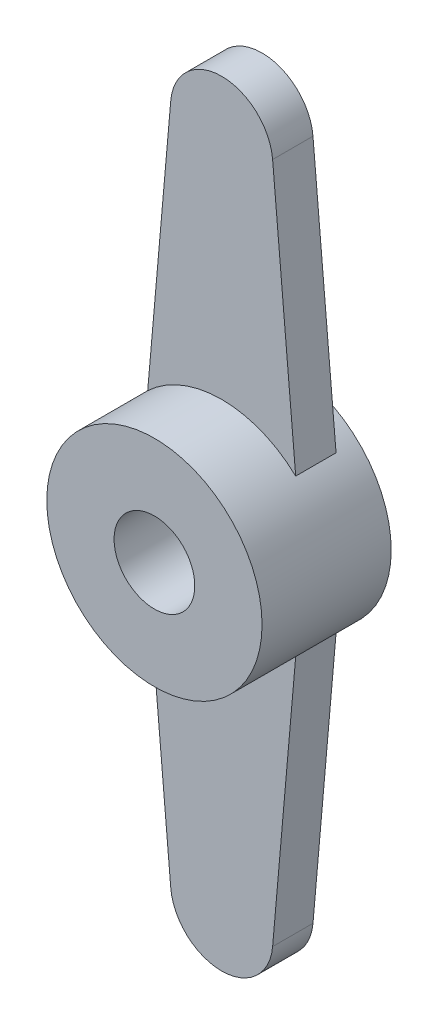
ISO-10303-21;
HEADER;
FILE_DESCRIPTION(('STEP AP214'),'2;1');
FILE_NAME('part.step','',(''),(''),'','','');
FILE_SCHEMA(('AUTOMOTIVE_DESIGN { 1 0 10303 214 1 1 1 1 }'));
ENDSEC;
DATA;
#1=APPLICATION_CONTEXT('core data for automotive mechanical design processes');
#2=APPLICATION_PROTOCOL_DEFINITION('international standard','automotive_design',2000,#1);
#3=PRODUCT_CONTEXT('',#1,'mechanical');
#4=PRODUCT('Part','Part','',(#3));
#5=PRODUCT_RELATED_PRODUCT_CATEGORY('part','',(#4));
#6=PRODUCT_DEFINITION_FORMATION('','',#4);
#7=PRODUCT_DEFINITION_CONTEXT('part definition',#1,'design');
#8=PRODUCT_DEFINITION('design','',#6,#7);
#9=PRODUCT_DEFINITION_SHAPE('','',#8);
#10=(LENGTH_UNIT() NAMED_UNIT(*) SI_UNIT(.MILLI.,.METRE.));
#11=(NAMED_UNIT(*) PLANE_ANGLE_UNIT() SI_UNIT($,.RADIAN.));
#12=(NAMED_UNIT(*) SI_UNIT($,.STERADIAN.) SOLID_ANGLE_UNIT());
#13=UNCERTAINTY_MEASURE_WITH_UNIT(LENGTH_MEASURE(1.E-05),#10,'distance_accuracy_value','');
#14=(GEOMETRIC_REPRESENTATION_CONTEXT(3) GLOBAL_UNCERTAINTY_ASSIGNED_CONTEXT((#13)) GLOBAL_UNIT_ASSIGNED_CONTEXT((#10,
#11,#12)) REPRESENTATION_CONTEXT('',''));
#15=CARTESIAN_POINT('',(0.,0.,0.));
#16=DIRECTION('',(0.,0.,1.));
#17=DIRECTION('',(1.,0.,0.));
#18=AXIS2_PLACEMENT_3D('',#15,#16,#17);
#19=CARTESIAN_POINT('',(0.,-12.5,0.));
#20=DIRECTION('',(0.,0.,1.));
#21=DIRECTION('',(1.,0.,0.));
#22=AXIS2_PLACEMENT_3D('',#19,#20,#21);
#23=PLANE('',#22);
#24=CARTESIAN_POINT('',(0.,0.,0.));
#25=DIRECTION('',(0.,0.,-1.));
#26=DIRECTION('',(-1.,0.,0.));
#27=AXIS2_PLACEMENT_3D('',#24,#25,#26);
#28=CIRCLE('',#27,4.);
#29=CARTESIAN_POINT('',(-2.75,2.90473750965556,0.));
#30=VERTEX_POINT('',#29);
#31=CARTESIAN_POINT('',(2.75,2.90473750965556,0.));
#32=VERTEX_POINT('',#31);
#33=EDGE_CURVE('E134',#30,#32,#28,.T.);
#34=ORIENTED_EDGE('',*,*,#33,.F.);
#35=DIRECTION('',(-0.0874864753555523,-0.996165707415118,0.));
#36=VECTOR('',#35,1.);
#37=CARTESIAN_POINT('',(-1.89271484408872,12.6662243031756,0.));
#38=LINE('',#37,#36);
#39=CARTESIAN_POINT('',(-1.89271484408872,12.6662243031756,0.));
#40=VERTEX_POINT('',#39);
#41=EDGE_CURVE('E117',#40,#30,#38,.T.);
#42=ORIENTED_EDGE('',*,*,#41,.F.);
#43=CARTESIAN_POINT('',(0.,12.5,0.));
#44=DIRECTION('',(0.,0.,1.));
#45=DIRECTION('',(1.,0.,0.));
#46=AXIS2_PLACEMENT_3D('',#43,#44,#45);
#47=CIRCLE('',#46,1.9);
#48=CARTESIAN_POINT('',(1.89271484408872,12.6662243031756,0.));
#49=VERTEX_POINT('',#48);
#50=EDGE_CURVE('E333',#49,#40,#47,.T.);
#51=ORIENTED_EDGE('',*,*,#50,.F.);
#52=DIRECTION('',(-0.0874864753555523,0.996165707415118,0.));
#53=VECTOR('',#52,1.);
#54=CARTESIAN_POINT('',(1.89271484408872,12.6662243031756,0.));
#55=LINE('',#54,#53);
#56=EDGE_CURVE('E331',#32,#49,#55,.T.);
#57=ORIENTED_EDGE('',*,*,#56,.F.);
#58=EDGE_LOOP('',(#34,#42,#51,#57));
#59=FACE_BOUND('',#58,.T.);
#60=ADVANCED_FACE('F33',(#59),#23,.F.);
#61=CARTESIAN_POINT('',(2.75,-2.90473750965556,0.));
#62=VERTEX_POINT('',#61);
#63=CARTESIAN_POINT('',(-2.75,-2.90473750965556,0.));
#64=VERTEX_POINT('',#63);
#65=EDGE_CURVE('E11',#62,#64,#28,.T.);
#66=ORIENTED_EDGE('',*,*,#65,.F.);
#67=DIRECTION('',(0.0874864753555523,0.996165707415118,0.));
#68=VECTOR('',#67,1.);
#69=CARTESIAN_POINT('',(2.75,-2.90473750965556,0.));
#70=LINE('',#69,#68);
#71=CARTESIAN_POINT('',(1.89271484408872,-12.6662243031756,0.));
#72=VERTEX_POINT('',#71);
#73=EDGE_CURVE('E328',#72,#62,#70,.T.);
#74=ORIENTED_EDGE('',*,*,#73,.F.);
#75=CARTESIAN_POINT('',(0.,-12.5,0.));
#76=DIRECTION('',(0.,0.,1.));
#77=DIRECTION('',(1.,0.,0.));
#78=AXIS2_PLACEMENT_3D('',#75,#76,#77);
#79=CIRCLE('',#78,1.9);
#80=CARTESIAN_POINT('',(-1.89271484408872,-12.6662243031756,0.));
#81=VERTEX_POINT('',#80);
#82=EDGE_CURVE('E131',#81,#72,#79,.T.);
#83=ORIENTED_EDGE('',*,*,#82,.F.);
#84=DIRECTION('',(0.0874864753555523,-0.996165707415118,0.));
#85=VECTOR('',#84,1.);
#86=CARTESIAN_POINT('',(-2.75,-2.90473750965556,0.));
#87=LINE('',#86,#85);
#88=EDGE_CURVE('E77',#64,#81,#87,.T.);
#89=ORIENTED_EDGE('',*,*,#88,.F.);
#90=EDGE_LOOP('',(#66,#74,#83,#89));
#91=FACE_BOUND('',#90,.T.);
#92=ADVANCED_FACE('F213',(#91),#23,.F.);
#93=CARTESIAN_POINT('',(0.,-12.5,1.5));
#94=DIRECTION('',(0.,0.,1.));
#95=DIRECTION('',(1.,0.,0.));
#96=AXIS2_PLACEMENT_3D('',#93,#94,#95);
#97=PLANE('',#96);
#98=CARTESIAN_POINT('',(0.,0.,1.5));
#99=DIRECTION('',(0.,0.,1.));
#100=DIRECTION('',(1.,0.,0.));
#101=AXIS2_PLACEMENT_3D('',#98,#99,#100);
#102=CIRCLE('',#101,4.);
#103=CARTESIAN_POINT('',(2.75,2.90473750965556,1.5));
#104=VERTEX_POINT('',#103);
#105=CARTESIAN_POINT('',(-2.75,2.90473750965556,1.5));
#106=VERTEX_POINT('',#105);
#107=EDGE_CURVE('E104',#104,#106,#102,.T.);
#108=ORIENTED_EDGE('',*,*,#107,.F.);
#109=DIRECTION('',(-0.0874864753555523,0.996165707415118,0.));
#110=VECTOR('',#109,1.);
#111=CARTESIAN_POINT('',(1.89271484408872,12.6662243031756,1.5));
#112=LINE('',#111,#110);
#113=CARTESIAN_POINT('',(1.89271484408872,12.6662243031756,1.5));
#114=VERTEX_POINT('',#113);
#115=EDGE_CURVE('E146',#104,#114,#112,.T.);
#116=ORIENTED_EDGE('',*,*,#115,.T.);
#117=CARTESIAN_POINT('',(0.,12.5,1.5));
#118=DIRECTION('',(0.,0.,1.));
#119=DIRECTION('',(1.,0.,0.));
#120=AXIS2_PLACEMENT_3D('',#117,#118,#119);
#121=CIRCLE('',#120,1.9);
#122=CARTESIAN_POINT('',(-1.89271484408872,12.6662243031756,1.5));
#123=VERTEX_POINT('',#122);
#124=EDGE_CURVE('E106',#114,#123,#121,.T.);
#125=ORIENTED_EDGE('',*,*,#124,.T.);
#126=DIRECTION('',(-0.0874864753555523,-0.996165707415118,0.));
#127=VECTOR('',#126,1.);
#128=CARTESIAN_POINT('',(-1.89271484408872,12.6662243031756,1.5));
#129=LINE('',#128,#127);
#130=EDGE_CURVE('E100',#123,#106,#129,.T.);
#131=ORIENTED_EDGE('',*,*,#130,.T.);
#132=EDGE_LOOP('',(#108,#116,#125,#131));
#133=FACE_BOUND('',#132,.T.);
#134=ADVANCED_FACE('F102',(#133),#97,.T.);
#135=CARTESIAN_POINT('',(0.,-12.5,1.5));
#136=DIRECTION('',(0.,0.,-1.));
#137=DIRECTION('',(-1.,0.,0.));
#138=AXIS2_PLACEMENT_3D('',#135,#136,#137);
#139=CYLINDRICAL_SURFACE('',#138,1.9);
#140=ORIENTED_EDGE('',*,*,#82,.T.);
#141=DIRECTION('',(0.,0.,-1.));
#142=VECTOR('',#141,1.);
#143=CARTESIAN_POINT('',(1.89271484408872,-12.6662243031756,1.5));
#144=LINE('',#143,#142);
#145=CARTESIAN_POINT('',(1.89271484408872,-12.6662243031756,1.5));
#146=VERTEX_POINT('',#145);
#147=EDGE_CURVE('E144',#146,#72,#144,.T.);
#148=ORIENTED_EDGE('',*,*,#147,.F.);
#149=CARTESIAN_POINT('',(0.,-12.5,1.5));
#150=DIRECTION('',(0.,0.,1.));
#151=DIRECTION('',(1.,0.,0.));
#152=AXIS2_PLACEMENT_3D('',#149,#150,#151);
#153=CIRCLE('',#152,1.9);
#154=CARTESIAN_POINT('',(-1.89271484408872,-12.6662243031756,1.5));
#155=VERTEX_POINT('',#154);
#156=EDGE_CURVE('E139',#155,#146,#153,.T.);
#157=ORIENTED_EDGE('',*,*,#156,.F.);
#158=DIRECTION('',(0.,0.,-1.));
#159=VECTOR('',#158,1.);
#160=CARTESIAN_POINT('',(-1.89271484408872,-12.6662243031756,1.5));
#161=LINE('',#160,#159);
#162=EDGE_CURVE('E163',#155,#81,#161,.T.);
#163=ORIENTED_EDGE('',*,*,#162,.T.);
#164=EDGE_LOOP('',(#140,#148,#157,#163));
#165=FACE_BOUND('',#164,.T.);
#166=ADVANCED_FACE('F35',(#165),#139,.T.);
#167=CARTESIAN_POINT('',(2.75,-2.90473750965556,1.5));
#168=DIRECTION('',(-0.996165707415118,0.0874864753555523,0.));
#169=DIRECTION('',(-0.0874864753555524,-0.996165707415118,0.));
#170=AXIS2_PLACEMENT_3D('',#167,#168,#169);
#171=PLANE('',#170);
#172=ORIENTED_EDGE('',*,*,#73,.T.);
#173=DIRECTION('',(0.,0.,-1.));
#174=VECTOR('',#173,1.);
#175=CARTESIAN_POINT('',(2.75,-2.90473750965556,1.5));
#176=LINE('',#175,#174);
#177=CARTESIAN_POINT('',(2.75,-2.90473750965556,1.5));
#178=VERTEX_POINT('',#177);
#179=EDGE_CURVE('E158',#178,#62,#176,.T.);
#180=ORIENTED_EDGE('',*,*,#179,.F.);
#181=DIRECTION('',(0.0874864753555523,0.996165707415118,0.));
#182=VECTOR('',#181,1.);
#183=CARTESIAN_POINT('',(2.75,-2.90473750965556,1.5));
#184=LINE('',#183,#182);
#185=EDGE_CURVE('E86',#146,#178,#184,.T.);
#186=ORIENTED_EDGE('',*,*,#185,.F.);
#187=ORIENTED_EDGE('',*,*,#147,.T.);
#188=EDGE_LOOP('',(#172,#180,#186,#187));
#189=FACE_BOUND('',#188,.T.);
#190=ADVANCED_FACE('F263',(#189),#171,.F.);
#191=CARTESIAN_POINT('',(1.89271484408872,12.6662243031756,1.5));
#192=DIRECTION('',(-0.996165707415118,-0.0874864753555523,0.));
#193=DIRECTION('',(0.0874864753555524,-0.996165707415118,0.));
#194=AXIS2_PLACEMENT_3D('',#191,#192,#193);
#195=PLANE('',#194);
#196=ORIENTED_EDGE('',*,*,#56,.T.);
#197=DIRECTION('',(0.,0.,-1.));
#198=VECTOR('',#197,1.);
#199=CARTESIAN_POINT('',(1.89271484408872,12.6662243031756,1.5));
#200=LINE('',#199,#198);
#201=EDGE_CURVE('E336',#114,#49,#200,.T.);
#202=ORIENTED_EDGE('',*,*,#201,.F.);
#203=ORIENTED_EDGE('',*,*,#115,.F.);
#204=DIRECTION('',(0.,0.,-1.));
#205=VECTOR('',#204,1.);
#206=CARTESIAN_POINT('',(2.75,2.90473750965556,1.5));
#207=LINE('',#206,#205);
#208=EDGE_CURVE('E126',#104,#32,#207,.T.);
#209=ORIENTED_EDGE('',*,*,#208,.T.);
#210=EDGE_LOOP('',(#196,#202,#203,#209));
#211=FACE_BOUND('',#210,.T.);
#212=ADVANCED_FACE('F267',(#211),#195,.F.);
#213=CARTESIAN_POINT('',(0.,12.5,1.5));
#214=DIRECTION('',(0.,0.,-1.));
#215=DIRECTION('',(-1.,0.,0.));
#216=AXIS2_PLACEMENT_3D('',#213,#214,#215);
#217=CYLINDRICAL_SURFACE('',#216,1.9);
#218=ORIENTED_EDGE('',*,*,#50,.T.);
#219=DIRECTION('',(0.,0.,-1.));
#220=VECTOR('',#219,1.);
#221=CARTESIAN_POINT('',(-1.89271484408872,12.6662243031756,1.5));
#222=LINE('',#221,#220);
#223=EDGE_CURVE('E120',#123,#40,#222,.T.);
#224=ORIENTED_EDGE('',*,*,#223,.F.);
#225=ORIENTED_EDGE('',*,*,#124,.F.);
#226=ORIENTED_EDGE('',*,*,#201,.T.);
#227=EDGE_LOOP('',(#218,#224,#225,#226));
#228=FACE_BOUND('',#227,.T.);
#229=ADVANCED_FACE('F210',(#228),#217,.T.);
#230=CARTESIAN_POINT('',(-1.89271484408872,12.6662243031756,1.5));
#231=DIRECTION('',(0.996165707415118,-0.0874864753555523,0.));
#232=DIRECTION('',(0.0874864753555524,0.996165707415118,0.));
#233=AXIS2_PLACEMENT_3D('',#230,#231,#232);
#234=PLANE('',#233);
#235=ORIENTED_EDGE('',*,*,#41,.T.);
#236=DIRECTION('',(0.,0.,-1.));
#237=VECTOR('',#236,1.);
#238=CARTESIAN_POINT('',(-2.75,2.90473750965556,1.5));
#239=LINE('',#238,#237);
#240=EDGE_CURVE('E113',#106,#30,#239,.T.);
#241=ORIENTED_EDGE('',*,*,#240,.F.);
#242=ORIENTED_EDGE('',*,*,#130,.F.);
#243=ORIENTED_EDGE('',*,*,#223,.T.);
#244=EDGE_LOOP('',(#235,#241,#242,#243));
#245=FACE_BOUND('',#244,.T.);
#246=ADVANCED_FACE('F114',(#245),#234,.F.);
#247=CARTESIAN_POINT('',(0.,0.,1.5));
#248=DIRECTION('',(0.,0.,-1.));
#249=DIRECTION('',(-1.,0.,0.));
#250=AXIS2_PLACEMENT_3D('',#247,#248,#249);
#251=CYLINDRICAL_SURFACE('',#250,4.);
#252=ORIENTED_EDGE('',*,*,#33,.T.);
#253=ORIENTED_EDGE('',*,*,#208,.F.);
#254=ORIENTED_EDGE('',*,*,#107,.T.);
#255=ORIENTED_EDGE('',*,*,#240,.T.);
#256=EDGE_LOOP('',(#252,#253,#254,#255));
#257=FACE_BOUND('',#256,.T.);
#258=ORIENTED_EDGE('',*,*,#179,.T.);
#259=ORIENTED_EDGE('',*,*,#65,.T.);
#260=DIRECTION('',(0.,0.,-1.));
#261=VECTOR('',#260,1.);
#262=CARTESIAN_POINT('',(-2.75,-2.90473750965556,1.5));
#263=LINE('',#262,#261);
#264=CARTESIAN_POINT('',(-2.75,-2.90473750965556,1.5));
#265=VERTEX_POINT('',#264);
#266=EDGE_CURVE('E121',#265,#64,#263,.T.);
#267=ORIENTED_EDGE('',*,*,#266,.F.);
#268=EDGE_CURVE('E43',#265,#178,#102,.T.);
#269=ORIENTED_EDGE('',*,*,#268,.T.);
#270=EDGE_LOOP('',(#258,#259,#267,#269));
#271=FACE_BOUND('',#270,.T.);
#272=CARTESIAN_POINT('',(0.,0.,4.));
#273=DIRECTION('',(0.,0.,1.));
#274=DIRECTION('',(1.,0.,0.));
#275=AXIS2_PLACEMENT_3D('',#272,#273,#274);
#276=CIRCLE('',#275,4.);
#277=CARTESIAN_POINT('',(4.,0.,4.));
#278=VERTEX_POINT('',#277);
#279=EDGE_CURVE('E127',#278,#278,#276,.T.);
#280=ORIENTED_EDGE('',*,*,#279,.F.);
#281=EDGE_LOOP('',(#280));
#282=FACE_BOUND('',#281,.T.);
#283=CARTESIAN_POINT('',(0.,0.,-0.8));
#284=DIRECTION('',(0.,0.,-1.));
#285=DIRECTION('',(-1.,0.,0.));
#286=AXIS2_PLACEMENT_3D('',#283,#284,#285);
#287=CIRCLE('',#286,4.);
#288=CARTESIAN_POINT('',(-4.,0.,-0.8));
#289=VERTEX_POINT('',#288);
#290=EDGE_CURVE('E128',#289,#289,#287,.T.);
#291=ORIENTED_EDGE('',*,*,#290,.F.);
#292=EDGE_LOOP('',(#291));
#293=FACE_BOUND('',#292,.T.);
#294=ADVANCED_FACE('F124',(#257,#271,#282,#293),#251,.T.);
#295=CARTESIAN_POINT('',(-2.75,-2.90473750965556,1.5));
#296=DIRECTION('',(0.996165707415118,0.0874864753555523,0.));
#297=DIRECTION('',(-0.0874864753555524,0.996165707415118,0.));
#298=AXIS2_PLACEMENT_3D('',#295,#296,#297);
#299=PLANE('',#298);
#300=ORIENTED_EDGE('',*,*,#88,.T.);
#301=ORIENTED_EDGE('',*,*,#162,.F.);
#302=DIRECTION('',(0.0874864753555523,-0.996165707415118,0.));
#303=VECTOR('',#302,1.);
#304=CARTESIAN_POINT('',(-2.75,-2.90473750965556,1.5));
#305=LINE('',#304,#303);
#306=EDGE_CURVE('E52',#265,#155,#305,.T.);
#307=ORIENTED_EDGE('',*,*,#306,.F.);
#308=ORIENTED_EDGE('',*,*,#266,.T.);
#309=EDGE_LOOP('',(#300,#301,#307,#308));
#310=FACE_BOUND('',#309,.T.);
#311=ADVANCED_FACE('F200',(#310),#299,.F.);
#312=ORIENTED_EDGE('',*,*,#268,.F.);
#313=ORIENTED_EDGE('',*,*,#306,.T.);
#314=ORIENTED_EDGE('',*,*,#156,.T.);
#315=ORIENTED_EDGE('',*,*,#185,.T.);
#316=EDGE_LOOP('',(#312,#313,#314,#315));
#317=FACE_BOUND('',#316,.T.);
#318=ADVANCED_FACE('F207',(#317),#97,.T.);
#319=CARTESIAN_POINT('',(0.,0.,4.));
#320=DIRECTION('',(0.,0.,1.));
#321=DIRECTION('',(1.,0.,0.));
#322=AXIS2_PLACEMENT_3D('',#319,#320,#321);
#323=PLANE('',#322);
#324=CARTESIAN_POINT('',(0.,0.,4.));
#325=DIRECTION('',(0.,0.,-1.));
#326=DIRECTION('',(-1.,0.,0.));
#327=AXIS2_PLACEMENT_3D('',#324,#325,#326);
#328=CIRCLE('',#327,1.5);
#329=CARTESIAN_POINT('',(-1.5,0.,4.));
#330=VERTEX_POINT('',#329);
#331=EDGE_CURVE('E176',#330,#330,#328,.T.);
#332=ORIENTED_EDGE('',*,*,#331,.T.);
#333=EDGE_LOOP('',(#332));
#334=FACE_BOUND('',#333,.T.);
#335=ORIENTED_EDGE('',*,*,#279,.T.);
#336=EDGE_LOOP('',(#335));
#337=FACE_BOUND('',#336,.T.);
#338=ADVANCED_FACE('F184',(#334,#337),#323,.T.);
#339=CARTESIAN_POINT('',(0.,0.,-0.8));
#340=DIRECTION('',(0.,0.,-1.));
#341=DIRECTION('',(-1.,0.,0.));
#342=AXIS2_PLACEMENT_3D('',#339,#340,#341);
#343=PLANE('',#342);
#344=CARTESIAN_POINT('',(0.,0.,-0.8));
#345=DIRECTION('',(0.,0.,-1.));
#346=DIRECTION('',(-1.,0.,0.));
#347=AXIS2_PLACEMENT_3D('',#344,#345,#346);
#348=CIRCLE('',#347,1.5);
#349=CARTESIAN_POINT('',(-1.5,0.,-0.8));
#350=VERTEX_POINT('',#349);
#351=EDGE_CURVE('E178',#350,#350,#348,.T.);
#352=ORIENTED_EDGE('',*,*,#351,.F.);
#353=EDGE_LOOP('',(#352));
#354=FACE_BOUND('',#353,.T.);
#355=ORIENTED_EDGE('',*,*,#290,.T.);
#356=EDGE_LOOP('',(#355));
#357=FACE_BOUND('',#356,.T.);
#358=ADVANCED_FACE('F190',(#354,#357),#343,.T.);
#359=CARTESIAN_POINT('',(0.,0.,4.));
#360=DIRECTION('',(0.,0.,-1.));
#361=DIRECTION('',(-1.,0.,0.));
#362=AXIS2_PLACEMENT_3D('',#359,#360,#361);
#363=CYLINDRICAL_SURFACE('',#362,1.5);
#364=ORIENTED_EDGE('',*,*,#331,.F.);
#365=EDGE_LOOP('',(#364));
#366=FACE_BOUND('',#365,.T.);
#367=ORIENTED_EDGE('',*,*,#351,.T.);
#368=EDGE_LOOP('',(#367));
#369=FACE_BOUND('',#368,.T.);
#370=ADVANCED_FACE('F187',(#366,#369),#363,.F.);
#371=CLOSED_SHELL('',(#60,#92,#134,#166,#190,#212,#229,#246,#294,#311,#318,#338,#358,#370));
#372=MANIFOLD_SOLID_BREP('B2',#371);
#373=ADVANCED_BREP_SHAPE_REPRESENTATION('',(#18,#372),#14);
#374=SHAPE_DEFINITION_REPRESENTATION(#9,#373);
ENDSEC;
END-ISO-10303-21;
